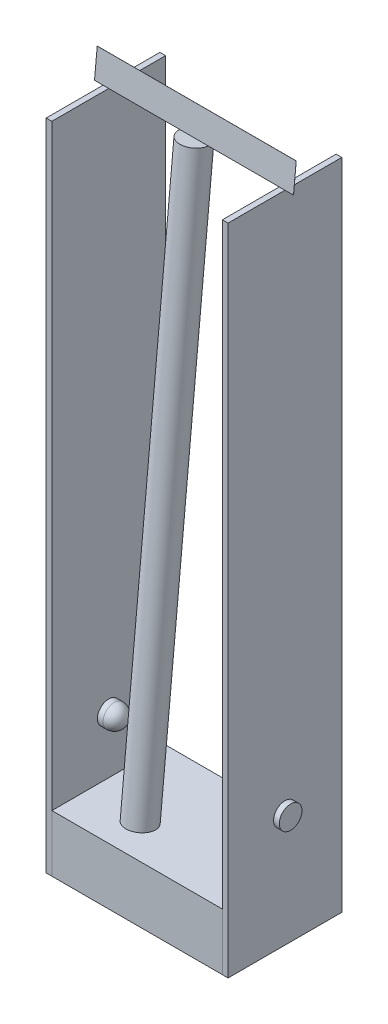
ISO-10303-21;
HEADER;
FILE_DESCRIPTION(('STEP AP214'),'2;1');
FILE_NAME('part.step','',(''),(''),'','','');
FILE_SCHEMA(('AUTOMOTIVE_DESIGN { 1 0 10303 214 1 1 1 1 }'));
ENDSEC;
DATA;
#1=APPLICATION_CONTEXT('core data for automotive mechanical design processes');
#2=APPLICATION_PROTOCOL_DEFINITION('international standard','automotive_design',2000,#1);
#3=PRODUCT_CONTEXT('',#1,'mechanical');
#4=PRODUCT('Part','Part','',(#3));
#5=PRODUCT_RELATED_PRODUCT_CATEGORY('part','',(#4));
#6=PRODUCT_DEFINITION_FORMATION('','',#4);
#7=PRODUCT_DEFINITION_CONTEXT('part definition',#1,'design');
#8=PRODUCT_DEFINITION('design','',#6,#7);
#9=PRODUCT_DEFINITION_SHAPE('','',#8);
#10=(LENGTH_UNIT() NAMED_UNIT(*) SI_UNIT(.MILLI.,.METRE.));
#11=(NAMED_UNIT(*) PLANE_ANGLE_UNIT() SI_UNIT($,.RADIAN.));
#12=(NAMED_UNIT(*) SI_UNIT($,.STERADIAN.) SOLID_ANGLE_UNIT());
#13=UNCERTAINTY_MEASURE_WITH_UNIT(LENGTH_MEASURE(1.E-05),#10,'distance_accuracy_value','');
#14=(GEOMETRIC_REPRESENTATION_CONTEXT(3) GLOBAL_UNCERTAINTY_ASSIGNED_CONTEXT((#13)) GLOBAL_UNIT_ASSIGNED_CONTEXT((#10,
#11,#12)) REPRESENTATION_CONTEXT('',''));
#15=CARTESIAN_POINT('',(0.,0.,0.));
#16=DIRECTION('',(0.,0.,1.));
#17=DIRECTION('',(1.,0.,0.));
#18=AXIS2_PLACEMENT_3D('',#15,#16,#17);
#19=CARTESIAN_POINT('',(17.5,114.999051909074,-0.00995495472593605));
#20=DIRECTION('',(0.,0.995495472593952,-0.0948090926279954));
#21=DIRECTION('',(0.,0.0948090926279955,0.995495472593952));
#22=AXIS2_PLACEMENT_3D('',#19,#20,#21);
#23=PLANE('',#22);
#24=CARTESIAN_POINT('',(0.,114.999051909074,-0.00995495472593845));
#25=DIRECTION('',(0.,-0.995495472593952,0.0948090926279955));
#26=DIRECTION('',(0.,-0.0948090926279955,-0.995495472593952));
#27=AXIS2_PLACEMENT_3D('',#24,#25,#26);
#28=CIRCLE('',#27,2.5);
#29=CARTESIAN_POINT('',(2.5,114.999051909074,-0.00995495472594131));
#30=VERTEX_POINT('',#29);
#31=CARTESIAN_POINT('',(2.49997999992,115.,0.));
#32=VERTEX_POINT('',#31);
#33=EDGE_CURVE('E58',#30,#32,#28,.T.);
#34=ORIENTED_EDGE('',*,*,#33,.F.);
#35=DIRECTION('',(-1.,0.,0.));
#36=VECTOR('',#35,1.);
#37=CARTESIAN_POINT('',(17.5,114.999051909074,-0.00995495472593605));
#38=LINE('',#37,#36);
#39=CARTESIAN_POINT('',(17.5,114.999051909074,-0.00995495472593605));
#40=VERTEX_POINT('',#39);
#41=EDGE_CURVE('E108',#40,#30,#38,.T.);
#42=ORIENTED_EDGE('',*,*,#41,.F.);
#43=DIRECTION('',(0.,0.0948090926279954,0.995495472593952));
#44=VECTOR('',#43,1.);
#45=CARTESIAN_POINT('',(17.5,114.999051909074,-0.00995495472593605));
#46=LINE('',#45,#44);
#47=CARTESIAN_POINT('',(17.5,115.,0.));
#48=VERTEX_POINT('',#47);
#49=EDGE_CURVE('E135',#40,#48,#46,.T.);
#50=ORIENTED_EDGE('',*,*,#49,.T.);
#51=DIRECTION('',(-1.,0.,0.));
#52=VECTOR('',#51,1.);
#53=CARTESIAN_POINT('',(17.5,115.,0.));
#54=LINE('',#53,#52);
#55=EDGE_CURVE('E136',#48,#32,#54,.T.);
#56=ORIENTED_EDGE('',*,*,#55,.T.);
#57=EDGE_LOOP('',(#34,#42,#50,#56));
#58=FACE_BOUND('',#57,.T.);
#59=ADVANCED_FACE('F48',(#58),#23,.F.);
#60=CARTESIAN_POINT('',(-2.49997999992,115.,0.));
#61=VERTEX_POINT('',#60);
#62=CARTESIAN_POINT('',(-2.5,114.999051909074,-0.00995495472594126));
#63=VERTEX_POINT('',#62);
#64=EDGE_CURVE('E12',#61,#63,#28,.T.);
#65=ORIENTED_EDGE('',*,*,#64,.F.);
#66=CARTESIAN_POINT('',(-17.5,115.,0.));
#67=VERTEX_POINT('',#66);
#68=EDGE_CURVE('E140',#61,#67,#54,.T.);
#69=ORIENTED_EDGE('',*,*,#68,.T.);
#70=DIRECTION('',(0.,0.0948090926279954,0.995495472593952));
#71=VECTOR('',#70,1.);
#72=CARTESIAN_POINT('',(-17.5,114.999051909074,-0.00995495472593605));
#73=LINE('',#72,#71);
#74=CARTESIAN_POINT('',(-17.5,114.999051909074,-0.00995495472593605));
#75=VERTEX_POINT('',#74);
#76=EDGE_CURVE('E52',#75,#67,#73,.T.);
#77=ORIENTED_EDGE('',*,*,#76,.F.);
#78=EDGE_CURVE('E105',#63,#75,#38,.T.);
#79=ORIENTED_EDGE('',*,*,#78,.F.);
#80=EDGE_LOOP('',(#65,#69,#77,#79));
#81=FACE_BOUND('',#80,.T.);
#82=ADVANCED_FACE('F50',(#81),#23,.F.);
#83=CARTESIAN_POINT('',(-17.5,114.999051909074,-0.00995495472593605));
#84=DIRECTION('',(1.,0.,0.));
#85=DIRECTION('',(0.,0.,-1.));
#86=AXIS2_PLACEMENT_3D('',#83,#84,#85);
#87=PLANE('',#86);
#88=DIRECTION('',(0.,0.995495472593952,-0.0948090926279954));
#89=VECTOR('',#88,1.);
#90=CARTESIAN_POINT('',(-17.5,115.,0.));
#91=LINE('',#90,#89);
#92=CARTESIAN_POINT('',(-17.5,119.97747736297,-0.474045463139974));
#93=VERTEX_POINT('',#92);
#94=EDGE_CURVE('E138',#67,#93,#91,.T.);
#95=ORIENTED_EDGE('',*,*,#94,.T.);
#96=DIRECTION('',(0.,0.0948090926279954,0.995495472593952));
#97=VECTOR('',#96,1.);
#98=CARTESIAN_POINT('',(-17.5,119.976529272043,-0.484000417865913));
#99=LINE('',#98,#97);
#100=CARTESIAN_POINT('',(-17.5,119.976529272043,-0.484000417865913));
#101=VERTEX_POINT('',#100);
#102=EDGE_CURVE('E150',#101,#93,#99,.T.);
#103=ORIENTED_EDGE('',*,*,#102,.F.);
#104=DIRECTION('',(0.,0.995495472593952,-0.0948090926279954));
#105=VECTOR('',#104,1.);
#106=CARTESIAN_POINT('',(-17.5,114.999051909074,-0.00995495472593605));
#107=LINE('',#106,#105);
#108=EDGE_CURVE('E127',#75,#101,#107,.T.);
#109=ORIENTED_EDGE('',*,*,#108,.F.);
#110=ORIENTED_EDGE('',*,*,#76,.T.);
#111=EDGE_LOOP('',(#95,#103,#109,#110));
#112=FACE_BOUND('',#111,.T.);
#113=ADVANCED_FACE('F155',(#112),#87,.F.);
#114=CARTESIAN_POINT('',(17.5,119.976529272043,-0.484000417865913));
#115=DIRECTION('',(0.,0.995495472593952,-0.0948090926279954));
#116=DIRECTION('',(0.,0.0948090926279955,0.995495472593952));
#117=AXIS2_PLACEMENT_3D('',#114,#115,#116);
#118=PLANE('',#117);
#119=DIRECTION('',(-1.,0.,0.));
#120=VECTOR('',#119,1.);
#121=CARTESIAN_POINT('',(17.5,119.97747736297,-0.474045463139974));
#122=LINE('',#121,#120);
#123=CARTESIAN_POINT('',(17.5,119.97747736297,-0.474045463139974));
#124=VERTEX_POINT('',#123);
#125=EDGE_CURVE('E143',#124,#93,#122,.T.);
#126=ORIENTED_EDGE('',*,*,#125,.F.);
#127=DIRECTION('',(0.,0.0948090926279954,0.995495472593952));
#128=VECTOR('',#127,1.);
#129=CARTESIAN_POINT('',(17.5,119.976529272043,-0.484000417865913));
#130=LINE('',#129,#128);
#131=CARTESIAN_POINT('',(17.5,119.976529272043,-0.484000417865913));
#132=VERTEX_POINT('',#131);
#133=EDGE_CURVE('E149',#132,#124,#130,.T.);
#134=ORIENTED_EDGE('',*,*,#133,.F.);
#135=DIRECTION('',(-1.,0.,0.));
#136=VECTOR('',#135,1.);
#137=CARTESIAN_POINT('',(17.5,119.976529272043,-0.484000417865913));
#138=LINE('',#137,#136);
#139=EDGE_CURVE('E129',#132,#101,#138,.T.);
#140=ORIENTED_EDGE('',*,*,#139,.T.);
#141=ORIENTED_EDGE('',*,*,#102,.T.);
#142=EDGE_LOOP('',(#126,#134,#140,#141));
#143=FACE_BOUND('',#142,.T.);
#144=ADVANCED_FACE('F169',(#143),#118,.T.);
#145=CARTESIAN_POINT('',(17.5,114.999051909074,-0.00995495472593605));
#146=DIRECTION('',(1.,0.,0.));
#147=DIRECTION('',(0.,1.,0.));
#148=AXIS2_PLACEMENT_3D('',#145,#146,#147);
#149=PLANE('',#148);
#150=DIRECTION('',(0.,0.995495472593952,-0.0948090926279954));
#151=VECTOR('',#150,1.);
#152=CARTESIAN_POINT('',(17.5,115.,0.));
#153=LINE('',#152,#151);
#154=EDGE_CURVE('E115',#48,#124,#153,.T.);
#155=ORIENTED_EDGE('',*,*,#154,.F.);
#156=ORIENTED_EDGE('',*,*,#49,.F.);
#157=DIRECTION('',(0.,0.995495472593952,-0.0948090926279954));
#158=VECTOR('',#157,1.);
#159=CARTESIAN_POINT('',(17.5,114.999051909074,-0.00995495472593605));
#160=LINE('',#159,#158);
#161=EDGE_CURVE('E132',#40,#132,#160,.T.);
#162=ORIENTED_EDGE('',*,*,#161,.T.);
#163=ORIENTED_EDGE('',*,*,#133,.T.);
#164=EDGE_LOOP('',(#155,#156,#162,#163));
#165=FACE_BOUND('',#164,.T.);
#166=ADVANCED_FACE('F160',(#165),#149,.T.);
#167=CARTESIAN_POINT('',(0.,1.03275977424226,10.8439776295437));
#168=DIRECTION('',(0.,-0.0948090926279954,-0.995495472593952));
#169=DIRECTION('',(0.,0.995495472593952,-0.0948090926279954));
#170=AXIS2_PLACEMENT_3D('',#167,#168,#169);
#171=PLANE('',#170);
#172=ORIENTED_EDGE('',*,*,#41,.T.);
#173=EDGE_CURVE('E103',#30,#63,#38,.T.);
#174=ORIENTED_EDGE('',*,*,#173,.T.);
#175=ORIENTED_EDGE('',*,*,#78,.T.);
#176=ORIENTED_EDGE('',*,*,#108,.T.);
#177=ORIENTED_EDGE('',*,*,#139,.F.);
#178=ORIENTED_EDGE('',*,*,#161,.F.);
#179=EDGE_LOOP('',(#172,#174,#175,#176,#177,#178));
#180=FACE_BOUND('',#179,.T.);
#181=ADVANCED_FACE('F104',(#180),#171,.T.);
#182=CARTESIAN_POINT('',(0.,1.03370786516854,10.8539325842697));
#183=DIRECTION('',(0.,-0.0948090926279954,-0.995495472593952));
#184=DIRECTION('',(0.,0.995495472593952,-0.0948090926279954));
#185=AXIS2_PLACEMENT_3D('',#182,#183,#184);
#186=PLANE('',#185);
#187=ORIENTED_EDGE('',*,*,#55,.F.);
#188=ORIENTED_EDGE('',*,*,#154,.T.);
#189=ORIENTED_EDGE('',*,*,#125,.T.);
#190=ORIENTED_EDGE('',*,*,#94,.F.);
#191=ORIENTED_EDGE('',*,*,#68,.F.);
#192=EDGE_CURVE('E139',#32,#61,#54,.T.);
#193=ORIENTED_EDGE('',*,*,#192,.F.);
#194=EDGE_LOOP('',(#187,#188,#189,#190,#191,#193));
#195=FACE_BOUND('',#194,.T.);
#196=ADVANCED_FACE('F177',(#195),#186,.F.);
#197=CARTESIAN_POINT('',(0.,114.999051909074,-0.00995495472593845));
#198=DIRECTION('',(0.,-0.995495472593952,0.0948090926279955));
#199=DIRECTION('',(0.,-0.0948090926279955,-0.995495472593952));
#200=AXIS2_PLACEMENT_3D('',#197,#198,#199);
#201=PLANE('',#200);
#202=EDGE_CURVE('E59',#32,#61,#28,.T.);
#203=ORIENTED_EDGE('',*,*,#202,.F.);
#204=ORIENTED_EDGE('',*,*,#192,.T.);
#205=EDGE_LOOP('',(#203,#204));
#206=FACE_BOUND('',#205,.T.);
#207=ADVANCED_FACE('F180',(#206),#201,.F.);
#208=CARTESIAN_POINT('',(0.,15.4495046496786,9.47095430807361));
#209=DIRECTION('',(0.,0.995495472593952,-0.0948090926279955));
#210=DIRECTION('',(0.,0.0948090926279955,0.995495472593952));
#211=AXIS2_PLACEMENT_3D('',#208,#209,#210);
#212=CYLINDRICAL_SURFACE('',#211,2.5);
#213=CARTESIAN_POINT('',(0.,15.4495046496786,9.47095430807361));
#214=DIRECTION('',(0.,-0.995495472593952,0.0948090926279955));
#215=DIRECTION('',(0.,-0.0948090926279955,-0.995495472593952));
#216=AXIS2_PLACEMENT_3D('',#213,#214,#215);
#217=CIRCLE('',#216,2.5);
#218=CARTESIAN_POINT('',(0.,15.2124819181086,6.98221562658873));
#219=VERTEX_POINT('',#218);
#220=EDGE_CURVE('E124',#219,#219,#217,.T.);
#221=ORIENTED_EDGE('',*,*,#220,.F.);
#222=EDGE_LOOP('',(#221));
#223=FACE_BOUND('',#222,.T.);
#224=ORIENTED_EDGE('',*,*,#33,.T.);
#225=ORIENTED_EDGE('',*,*,#202,.T.);
#226=ORIENTED_EDGE('',*,*,#64,.T.);
#227=EDGE_CURVE('E116',#63,#30,#28,.T.);
#228=ORIENTED_EDGE('',*,*,#227,.T.);
#229=EDGE_LOOP('',(#224,#225,#226,#228));
#230=FACE_BOUND('',#229,.T.);
#231=ADVANCED_FACE('F120',(#223,#230),#212,.T.);
#232=CARTESIAN_POINT('',(0.,15.4495046496786,9.47095430807361));
#233=DIRECTION('',(0.,-0.995495472593952,0.0948090926279955));
#234=DIRECTION('',(0.,-0.0948090926279955,-0.995495472593952));
#235=AXIS2_PLACEMENT_3D('',#232,#233,#234);
#236=PLANE('',#235);
#237=ORIENTED_EDGE('',*,*,#220,.T.);
#238=EDGE_LOOP('',(#237));
#239=FACE_BOUND('',#238,.T.);
#240=ADVANCED_FACE('F186',(#239),#236,.T.);
#241=ORIENTED_EDGE('',*,*,#173,.F.);
#242=ORIENTED_EDGE('',*,*,#227,.F.);
#243=EDGE_LOOP('',(#241,#242));
#244=FACE_BOUND('',#243,.T.);
#245=ADVANCED_FACE('F117',(#244),#201,.F.);
#246=CLOSED_SHELL('',(#59,#82,#113,#144,#166,#181,#196,#207,#231,#240,#245));
#247=MANIFOLD_SOLID_BREP('B2',#246);
#248=CARTESIAN_POINT('',(12.,20.,0.));
#249=DIRECTION('',(1.,0.,0.));
#250=DIRECTION('',(0.,0.,1.));
#251=AXIS2_PLACEMENT_3D('',#248,#249,#250);
#252=CYLINDRICAL_SURFACE('',#251,2.);
#253=CARTESIAN_POINT('',(14.,20.,0.));
#254=DIRECTION('',(-1.,0.,0.));
#255=DIRECTION('',(0.,0.,1.));
#256=AXIS2_PLACEMENT_3D('',#253,#254,#255);
#257=CIRCLE('',#256,2.);
#258=CARTESIAN_POINT('',(14.,20.,2.00000000000001));
#259=VERTEX_POINT('',#258);
#260=EDGE_CURVE('E47',#259,#259,#257,.T.);
#261=ORIENTED_EDGE('',*,*,#260,.F.);
#262=EDGE_LOOP('',(#261));
#263=FACE_BOUND('',#262,.T.);
#264=CARTESIAN_POINT('',(17.,20.,0.));
#265=DIRECTION('',(-1.,0.,0.));
#266=DIRECTION('',(0.,0.,1.));
#267=AXIS2_PLACEMENT_3D('',#264,#265,#266);
#268=CIRCLE('',#267,2.);
#269=CARTESIAN_POINT('',(17.,20.,2.00000000000001));
#270=VERTEX_POINT('',#269);
#271=EDGE_CURVE('E275',#270,#270,#268,.T.);
#272=ORIENTED_EDGE('',*,*,#271,.T.);
#273=EDGE_LOOP('',(#272));
#274=FACE_BOUND('',#273,.T.);
#275=ADVANCED_FACE('F268',(#263,#274),#252,.T.);
#276=CARTESIAN_POINT('',(17.,20.,0.));
#277=DIRECTION('',(1.,0.,0.));
#278=DIRECTION('',(0.,0.,1.));
#279=AXIS2_PLACEMENT_3D('',#276,#277,#278);
#280=PLANE('',#279);
#281=ORIENTED_EDGE('',*,*,#271,.F.);
#282=EDGE_LOOP('',(#281));
#283=FACE_BOUND('',#282,.T.);
#284=ADVANCED_FACE('F282',(#283),#280,.T.);
#285=CARTESIAN_POINT('',(14.,20.,0.));
#286=DIRECTION('',(1.,0.,0.));
#287=DIRECTION('',(0.,0.,1.));
#288=AXIS2_PLACEMENT_3D('',#285,#286,#287);
#289=SPHERICAL_SURFACE('',#288,2.);
#290=ORIENTED_EDGE('',*,*,#260,.T.);
#291=EDGE_LOOP('',(#290));
#292=FACE_BOUND('',#291,.T.);
#293=ADVANCED_FACE('F270',(#292),#289,.T.);
#294=CLOSED_SHELL('',(#275,#284,#293));
#295=MANIFOLD_SOLID_BREP('B6',#294);
#296=CARTESIAN_POINT('',(16.,0.,-10.));
#297=DIRECTION('',(0.,0.,1.));
#298=DIRECTION('',(-1.,0.,0.));
#299=AXIS2_PLACEMENT_3D('',#296,#297,#298);
#300=PLANE('',#299);
#301=DIRECTION('',(0.,-1.,0.));
#302=VECTOR('',#301,1.);
#303=CARTESIAN_POINT('',(15.,0.,-10.));
#304=LINE('',#303,#302);
#305=CARTESIAN_POINT('',(15.,115.,-10.));
#306=VERTEX_POINT('',#305);
#307=CARTESIAN_POINT('',(15.,0.,-10.));
#308=VERTEX_POINT('',#307);
#309=EDGE_CURVE('E389',#306,#308,#304,.T.);
#310=ORIENTED_EDGE('',*,*,#309,.F.);
#311=DIRECTION('',(-1.,0.,0.));
#312=VECTOR('',#311,1.);
#313=CARTESIAN_POINT('',(16.,115.,-10.));
#314=LINE('',#313,#312);
#315=CARTESIAN_POINT('',(16.,115.,-10.));
#316=VERTEX_POINT('',#315);
#317=EDGE_CURVE('E388',#316,#306,#314,.T.);
#318=ORIENTED_EDGE('',*,*,#317,.F.);
#319=DIRECTION('',(0.,-1.,0.));
#320=VECTOR('',#319,1.);
#321=CARTESIAN_POINT('',(16.,0.,-10.));
#322=LINE('',#321,#320);
#323=CARTESIAN_POINT('',(16.,0.,-10.));
#324=VERTEX_POINT('',#323);
#325=EDGE_CURVE('E382',#316,#324,#322,.T.);
#326=ORIENTED_EDGE('',*,*,#325,.T.);
#327=DIRECTION('',(-1.,0.,0.));
#328=VECTOR('',#327,1.);
#329=CARTESIAN_POINT('',(16.,0.,-10.));
#330=LINE('',#329,#328);
#331=EDGE_CURVE('E266',#324,#308,#330,.T.);
#332=ORIENTED_EDGE('',*,*,#331,.T.);
#333=EDGE_LOOP('',(#310,#318,#326,#332));
#334=FACE_BOUND('',#333,.T.);
#335=ADVANCED_FACE('F323',(#334),#300,.F.);
#336=CARTESIAN_POINT('',(16.,0.,-10.));
#337=DIRECTION('',(0.,1.,0.));
#338=DIRECTION('',(0.,0.,1.));
#339=AXIS2_PLACEMENT_3D('',#336,#337,#338);
#340=PLANE('',#339);
#341=DIRECTION('',(0.,0.,1.));
#342=VECTOR('',#341,1.);
#343=CARTESIAN_POINT('',(15.,0.,-10.));
#344=LINE('',#343,#342);
#345=CARTESIAN_POINT('',(15.,0.,10.));
#346=VERTEX_POINT('',#345);
#347=EDGE_CURVE('E391',#308,#346,#344,.T.);
#348=ORIENTED_EDGE('',*,*,#347,.F.);
#349=ORIENTED_EDGE('',*,*,#331,.F.);
#350=DIRECTION('',(0.,0.,1.));
#351=VECTOR('',#350,1.);
#352=CARTESIAN_POINT('',(16.,0.,-10.));
#353=LINE('',#352,#351);
#354=CARTESIAN_POINT('',(16.,0.,10.));
#355=VERTEX_POINT('',#354);
#356=EDGE_CURVE('E365',#324,#355,#353,.T.);
#357=ORIENTED_EDGE('',*,*,#356,.T.);
#358=DIRECTION('',(-1.,0.,0.));
#359=VECTOR('',#358,1.);
#360=CARTESIAN_POINT('',(16.,0.,10.));
#361=LINE('',#360,#359);
#362=EDGE_CURVE('E332',#355,#346,#361,.T.);
#363=ORIENTED_EDGE('',*,*,#362,.T.);
#364=EDGE_LOOP('',(#348,#349,#357,#363));
#365=FACE_BOUND('',#364,.T.);
#366=ADVANCED_FACE('F380',(#365),#340,.F.);
#367=CARTESIAN_POINT('',(16.,0.,10.));
#368=DIRECTION('',(0.,0.,-1.));
#369=DIRECTION('',(1.,0.,0.));
#370=AXIS2_PLACEMENT_3D('',#367,#368,#369);
#371=PLANE('',#370);
#372=DIRECTION('',(0.,1.,0.));
#373=VECTOR('',#372,1.);
#374=CARTESIAN_POINT('',(15.,0.,10.));
#375=LINE('',#374,#373);
#376=CARTESIAN_POINT('',(15.,115.,9.99999999999998));
#377=VERTEX_POINT('',#376);
#378=EDGE_CURVE('E375',#346,#377,#375,.T.);
#379=ORIENTED_EDGE('',*,*,#378,.F.);
#380=ORIENTED_EDGE('',*,*,#362,.F.);
#381=DIRECTION('',(0.,1.,0.));
#382=VECTOR('',#381,1.);
#383=CARTESIAN_POINT('',(16.,0.,10.));
#384=LINE('',#383,#382);
#385=CARTESIAN_POINT('',(16.,115.,9.99999999999998));
#386=VERTEX_POINT('',#385);
#387=EDGE_CURVE('E368',#355,#386,#384,.T.);
#388=ORIENTED_EDGE('',*,*,#387,.T.);
#389=DIRECTION('',(-1.,0.,0.));
#390=VECTOR('',#389,1.);
#391=CARTESIAN_POINT('',(16.,115.,9.99999999999998));
#392=LINE('',#391,#390);
#393=EDGE_CURVE('E378',#386,#377,#392,.T.);
#394=ORIENTED_EDGE('',*,*,#393,.T.);
#395=EDGE_LOOP('',(#379,#380,#388,#394));
#396=FACE_BOUND('',#395,.T.);
#397=ADVANCED_FACE('F374',(#396),#371,.F.);
#398=CARTESIAN_POINT('',(16.,115.,-10.));
#399=DIRECTION('',(0.,-1.,0.));
#400=DIRECTION('',(0.,0.,-1.));
#401=AXIS2_PLACEMENT_3D('',#398,#399,#400);
#402=PLANE('',#401);
#403=DIRECTION('',(0.,0.,-1.));
#404=VECTOR('',#403,1.);
#405=CARTESIAN_POINT('',(15.,115.,-10.));
#406=LINE('',#405,#404);
#407=EDGE_CURVE('E354',#377,#306,#406,.T.);
#408=ORIENTED_EDGE('',*,*,#407,.F.);
#409=ORIENTED_EDGE('',*,*,#393,.F.);
#410=DIRECTION('',(0.,0.,-1.));
#411=VECTOR('',#410,1.);
#412=CARTESIAN_POINT('',(16.,115.,-10.));
#413=LINE('',#412,#411);
#414=EDGE_CURVE('E340',#386,#316,#413,.T.);
#415=ORIENTED_EDGE('',*,*,#414,.T.);
#416=ORIENTED_EDGE('',*,*,#317,.T.);
#417=EDGE_LOOP('',(#408,#409,#415,#416));
#418=FACE_BOUND('',#417,.T.);
#419=ADVANCED_FACE('F401',(#418),#402,.F.);
#420=CARTESIAN_POINT('',(16.,0.,0.));
#421=DIRECTION('',(-1.,0.,0.));
#422=DIRECTION('',(0.,0.,-1.));
#423=AXIS2_PLACEMENT_3D('',#420,#421,#422);
#424=PLANE('',#423);
#425=CARTESIAN_POINT('',(16.,20.,0.));
#426=DIRECTION('',(-1.,0.,0.));
#427=DIRECTION('',(0.,0.,1.));
#428=AXIS2_PLACEMENT_3D('',#425,#426,#427);
#429=CIRCLE('',#428,2.);
#430=CARTESIAN_POINT('',(16.,20.,1.99999999999999));
#431=VERTEX_POINT('',#430);
#432=EDGE_CURVE('E392',#431,#431,#429,.T.);
#433=ORIENTED_EDGE('',*,*,#432,.T.);
#434=EDGE_LOOP('',(#433));
#435=FACE_BOUND('',#434,.T.);
#436=ORIENTED_EDGE('',*,*,#325,.F.);
#437=ORIENTED_EDGE('',*,*,#414,.F.);
#438=ORIENTED_EDGE('',*,*,#387,.F.);
#439=ORIENTED_EDGE('',*,*,#356,.F.);
#440=EDGE_LOOP('',(#436,#437,#438,#439));
#441=FACE_BOUND('',#440,.T.);
#442=ADVANCED_FACE('F370',(#435,#441),#424,.F.);
#443=CARTESIAN_POINT('',(15.,0.,0.));
#444=DIRECTION('',(-1.,0.,0.));
#445=DIRECTION('',(0.,0.,-1.));
#446=AXIS2_PLACEMENT_3D('',#443,#444,#445);
#447=PLANE('',#446);
#448=CARTESIAN_POINT('',(15.,20.,0.));
#449=DIRECTION('',(-1.,0.,0.));
#450=DIRECTION('',(0.,0.,1.));
#451=AXIS2_PLACEMENT_3D('',#448,#449,#450);
#452=CIRCLE('',#451,2.);
#453=CARTESIAN_POINT('',(15.,20.,2.));
#454=VERTEX_POINT('',#453);
#455=EDGE_CURVE('E326',#454,#454,#452,.T.);
#456=ORIENTED_EDGE('',*,*,#455,.F.);
#457=EDGE_LOOP('',(#456));
#458=FACE_BOUND('',#457,.T.);
#459=ORIENTED_EDGE('',*,*,#309,.T.);
#460=ORIENTED_EDGE('',*,*,#347,.T.);
#461=ORIENTED_EDGE('',*,*,#378,.T.);
#462=ORIENTED_EDGE('',*,*,#407,.T.);
#463=EDGE_LOOP('',(#459,#460,#461,#462));
#464=FACE_BOUND('',#463,.T.);
#465=ADVANCED_FACE('F397',(#458,#464),#447,.T.);
#466=CARTESIAN_POINT('',(17.5,20.,0.));
#467=DIRECTION('',(-1.,0.,0.));
#468=DIRECTION('',(0.,0.,1.));
#469=AXIS2_PLACEMENT_3D('',#466,#467,#468);
#470=CYLINDRICAL_SURFACE('',#469,2.);
#471=ORIENTED_EDGE('',*,*,#455,.T.);
#472=EDGE_LOOP('',(#471));
#473=FACE_BOUND('',#472,.T.);
#474=ORIENTED_EDGE('',*,*,#432,.F.);
#475=EDGE_LOOP('',(#474));
#476=FACE_BOUND('',#475,.T.);
#477=ADVANCED_FACE('F458',(#473,#476),#470,.F.);
#478=CLOSED_SHELL('',(#335,#366,#397,#419,#442,#465,#477));
#479=MANIFOLD_SOLID_BREP('B42',#478);
#480=CARTESIAN_POINT('',(-12.,20.,0.));
#481=DIRECTION('',(-1.,0.,0.));
#482=DIRECTION('',(0.,0.,1.));
#483=AXIS2_PLACEMENT_3D('',#480,#481,#482);
#484=CYLINDRICAL_SURFACE('',#483,2.);
#485=CARTESIAN_POINT('',(-14.,20.,0.));
#486=DIRECTION('',(-1.,0.,0.));
#487=DIRECTION('',(0.,0.,1.));
#488=AXIS2_PLACEMENT_3D('',#485,#486,#487);
#489=CIRCLE('',#488,2.);
#490=CARTESIAN_POINT('',(-14.,20.,2.00000000000001));
#491=VERTEX_POINT('',#490);
#492=EDGE_CURVE('E322',#491,#491,#489,.T.);
#493=ORIENTED_EDGE('',*,*,#492,.T.);
#494=EDGE_LOOP('',(#493));
#495=FACE_BOUND('',#494,.T.);
#496=CARTESIAN_POINT('',(-17.,20.,0.));
#497=DIRECTION('',(-1.,0.,0.));
#498=DIRECTION('',(0.,0.,1.));
#499=AXIS2_PLACEMENT_3D('',#496,#497,#498);
#500=CIRCLE('',#499,2.);
#501=CARTESIAN_POINT('',(-17.,20.,2.00000000000001));
#502=VERTEX_POINT('',#501);
#503=EDGE_CURVE('E510',#502,#502,#500,.T.);
#504=ORIENTED_EDGE('',*,*,#503,.F.);
#505=EDGE_LOOP('',(#504));
#506=FACE_BOUND('',#505,.T.);
#507=ADVANCED_FACE('F503',(#495,#506),#484,.T.);
#508=CARTESIAN_POINT('',(-17.,20.,0.));
#509=DIRECTION('',(-1.,0.,0.));
#510=DIRECTION('',(0.,0.,1.));
#511=AXIS2_PLACEMENT_3D('',#508,#509,#510);
#512=PLANE('',#511);
#513=ORIENTED_EDGE('',*,*,#503,.T.);
#514=EDGE_LOOP('',(#513));
#515=FACE_BOUND('',#514,.T.);
#516=ADVANCED_FACE('F516',(#515),#512,.T.);
#517=CARTESIAN_POINT('',(-14.,20.,0.));
#518=DIRECTION('',(-1.,0.,0.));
#519=DIRECTION('',(0.,0.,1.));
#520=AXIS2_PLACEMENT_3D('',#517,#518,#519);
#521=SPHERICAL_SURFACE('',#520,2.);
#522=ORIENTED_EDGE('',*,*,#492,.F.);
#523=EDGE_LOOP('',(#522));
#524=FACE_BOUND('',#523,.T.);
#525=ADVANCED_FACE('F505',(#524),#521,.T.);
#526=CLOSED_SHELL('',(#507,#516,#525));
#527=MANIFOLD_SOLID_BREP('B260',#526);
#528=CARTESIAN_POINT('',(-16.,0.,-10.));
#529=DIRECTION('',(0.,0.,1.));
#530=DIRECTION('',(1.,0.,0.));
#531=AXIS2_PLACEMENT_3D('',#528,#529,#530);
#532=PLANE('',#531);
#533=DIRECTION('',(0.,-1.,0.));
#534=VECTOR('',#533,1.);
#535=CARTESIAN_POINT('',(-15.,0.,-10.));
#536=LINE('',#535,#534);
#537=CARTESIAN_POINT('',(-15.,115.,-10.));
#538=VERTEX_POINT('',#537);
#539=CARTESIAN_POINT('',(-15.,0.,-10.));
#540=VERTEX_POINT('',#539);
#541=EDGE_CURVE('E618',#538,#540,#536,.T.);
#542=ORIENTED_EDGE('',*,*,#541,.T.);
#543=DIRECTION('',(1.,0.,0.));
#544=VECTOR('',#543,1.);
#545=CARTESIAN_POINT('',(-16.,0.,-10.));
#546=LINE('',#545,#544);
#547=CARTESIAN_POINT('',(-16.,0.,-10.));
#548=VERTEX_POINT('',#547);
#549=EDGE_CURVE('E501',#548,#540,#546,.T.);
#550=ORIENTED_EDGE('',*,*,#549,.F.);
#551=DIRECTION('',(0.,-1.,0.));
#552=VECTOR('',#551,1.);
#553=CARTESIAN_POINT('',(-16.,0.,-10.));
#554=LINE('',#553,#552);
#555=CARTESIAN_POINT('',(-16.,115.,-10.));
#556=VERTEX_POINT('',#555);
#557=EDGE_CURVE('E605',#556,#548,#554,.T.);
#558=ORIENTED_EDGE('',*,*,#557,.F.);
#559=DIRECTION('',(1.,0.,0.));
#560=VECTOR('',#559,1.);
#561=CARTESIAN_POINT('',(-16.,115.,-10.));
#562=LINE('',#561,#560);
#563=EDGE_CURVE('E614',#556,#538,#562,.T.);
#564=ORIENTED_EDGE('',*,*,#563,.T.);
#565=EDGE_LOOP('',(#542,#550,#558,#564));
#566=FACE_BOUND('',#565,.T.);
#567=ADVANCED_FACE('F553',(#566),#532,.F.);
#568=CARTESIAN_POINT('',(-16.,0.,-10.));
#569=DIRECTION('',(0.,1.,0.));
#570=DIRECTION('',(0.,0.,1.));
#571=AXIS2_PLACEMENT_3D('',#568,#569,#570);
#572=PLANE('',#571);
#573=DIRECTION('',(0.,0.,1.));
#574=VECTOR('',#573,1.);
#575=CARTESIAN_POINT('',(-15.,0.,-10.));
#576=LINE('',#575,#574);
#577=CARTESIAN_POINT('',(-15.,0.,10.));
#578=VERTEX_POINT('',#577);
#579=EDGE_CURVE('E609',#540,#578,#576,.T.);
#580=ORIENTED_EDGE('',*,*,#579,.T.);
#581=DIRECTION('',(1.,0.,0.));
#582=VECTOR('',#581,1.);
#583=CARTESIAN_POINT('',(-16.,0.,10.));
#584=LINE('',#583,#582);
#585=CARTESIAN_POINT('',(-16.,0.,10.));
#586=VERTEX_POINT('',#585);
#587=EDGE_CURVE('E562',#586,#578,#584,.T.);
#588=ORIENTED_EDGE('',*,*,#587,.F.);
#589=DIRECTION('',(0.,0.,1.));
#590=VECTOR('',#589,1.);
#591=CARTESIAN_POINT('',(-16.,0.,-10.));
#592=LINE('',#591,#590);
#593=EDGE_CURVE('E600',#548,#586,#592,.T.);
#594=ORIENTED_EDGE('',*,*,#593,.F.);
#595=ORIENTED_EDGE('',*,*,#549,.T.);
#596=EDGE_LOOP('',(#580,#588,#594,#595));
#597=FACE_BOUND('',#596,.T.);
#598=ADVANCED_FACE('F608',(#597),#572,.F.);
#599=CARTESIAN_POINT('',(-16.,0.,10.));
#600=DIRECTION('',(0.,0.,-1.));
#601=DIRECTION('',(-1.,0.,0.));
#602=AXIS2_PLACEMENT_3D('',#599,#600,#601);
#603=PLANE('',#602);
#604=DIRECTION('',(0.,1.,0.));
#605=VECTOR('',#604,1.);
#606=CARTESIAN_POINT('',(-15.,0.,10.));
#607=LINE('',#606,#605);
#608=CARTESIAN_POINT('',(-15.,115.,9.99999999999998));
#609=VERTEX_POINT('',#608);
#610=EDGE_CURVE('E587',#578,#609,#607,.T.);
#611=ORIENTED_EDGE('',*,*,#610,.T.);
#612=DIRECTION('',(1.,0.,0.));
#613=VECTOR('',#612,1.);
#614=CARTESIAN_POINT('',(-16.,115.,9.99999999999998));
#615=LINE('',#614,#613);
#616=CARTESIAN_POINT('',(-16.,115.,9.99999999999998));
#617=VERTEX_POINT('',#616);
#618=EDGE_CURVE('E610',#617,#609,#615,.T.);
#619=ORIENTED_EDGE('',*,*,#618,.F.);
#620=DIRECTION('',(0.,1.,0.));
#621=VECTOR('',#620,1.);
#622=CARTESIAN_POINT('',(-16.,0.,10.));
#623=LINE('',#622,#621);
#624=EDGE_CURVE('E603',#586,#617,#623,.T.);
#625=ORIENTED_EDGE('',*,*,#624,.F.);
#626=ORIENTED_EDGE('',*,*,#587,.T.);
#627=EDGE_LOOP('',(#611,#619,#625,#626));
#628=FACE_BOUND('',#627,.T.);
#629=ADVANCED_FACE('F612',(#628),#603,.F.);
#630=CARTESIAN_POINT('',(-16.,115.,-10.));
#631=DIRECTION('',(0.,-1.,0.));
#632=DIRECTION('',(0.,0.,-1.));
#633=AXIS2_PLACEMENT_3D('',#630,#631,#632);
#634=PLANE('',#633);
#635=DIRECTION('',(0.,0.,-1.));
#636=VECTOR('',#635,1.);
#637=CARTESIAN_POINT('',(-15.,115.,-10.));
#638=LINE('',#637,#636);
#639=EDGE_CURVE('E593',#609,#538,#638,.T.);
#640=ORIENTED_EDGE('',*,*,#639,.T.);
#641=ORIENTED_EDGE('',*,*,#563,.F.);
#642=DIRECTION('',(0.,0.,-1.));
#643=VECTOR('',#642,1.);
#644=CARTESIAN_POINT('',(-16.,115.,-10.));
#645=LINE('',#644,#643);
#646=EDGE_CURVE('E570',#617,#556,#645,.T.);
#647=ORIENTED_EDGE('',*,*,#646,.F.);
#648=ORIENTED_EDGE('',*,*,#618,.T.);
#649=EDGE_LOOP('',(#640,#641,#647,#648));
#650=FACE_BOUND('',#649,.T.);
#651=ADVANCED_FACE('F626',(#650),#634,.F.);
#652=CARTESIAN_POINT('',(-16.,0.,0.));
#653=DIRECTION('',(1.,0.,0.));
#654=DIRECTION('',(0.,0.,-1.));
#655=AXIS2_PLACEMENT_3D('',#652,#653,#654);
#656=PLANE('',#655);
#657=CARTESIAN_POINT('',(-16.,20.,0.));
#658=DIRECTION('',(1.,0.,0.));
#659=DIRECTION('',(0.,0.,-1.));
#660=AXIS2_PLACEMENT_3D('',#657,#658,#659);
#661=CIRCLE('',#660,2.);
#662=CARTESIAN_POINT('',(-16.,20.,-1.99999999999999));
#663=VERTEX_POINT('',#662);
#664=EDGE_CURVE('E621',#663,#663,#661,.T.);
#665=ORIENTED_EDGE('',*,*,#664,.T.);
#666=EDGE_LOOP('',(#665));
#667=FACE_BOUND('',#666,.T.);
#668=ORIENTED_EDGE('',*,*,#557,.T.);
#669=ORIENTED_EDGE('',*,*,#593,.T.);
#670=ORIENTED_EDGE('',*,*,#624,.T.);
#671=ORIENTED_EDGE('',*,*,#646,.T.);
#672=EDGE_LOOP('',(#668,#669,#670,#671));
#673=FACE_BOUND('',#672,.T.);
#674=ADVANCED_FACE('F601',(#667,#673),#656,.F.);
#675=CARTESIAN_POINT('',(-15.,0.,0.));
#676=DIRECTION('',(1.,0.,0.));
#677=DIRECTION('',(0.,0.,-1.));
#678=AXIS2_PLACEMENT_3D('',#675,#676,#677);
#679=PLANE('',#678);
#680=CARTESIAN_POINT('',(-15.,20.,0.));
#681=DIRECTION('',(1.,0.,0.));
#682=DIRECTION('',(0.,0.,-1.));
#683=AXIS2_PLACEMENT_3D('',#680,#681,#682);
#684=CIRCLE('',#683,2.);
#685=CARTESIAN_POINT('',(-15.,20.,-2.));
#686=VERTEX_POINT('',#685);
#687=EDGE_CURVE('E556',#686,#686,#684,.T.);
#688=ORIENTED_EDGE('',*,*,#687,.F.);
#689=EDGE_LOOP('',(#688));
#690=FACE_BOUND('',#689,.T.);
#691=ORIENTED_EDGE('',*,*,#541,.F.);
#692=ORIENTED_EDGE('',*,*,#639,.F.);
#693=ORIENTED_EDGE('',*,*,#610,.F.);
#694=ORIENTED_EDGE('',*,*,#579,.F.);
#695=EDGE_LOOP('',(#691,#692,#693,#694));
#696=FACE_BOUND('',#695,.T.);
#697=ADVANCED_FACE('F629',(#690,#696),#679,.T.);
#698=CARTESIAN_POINT('',(17.5,20.,0.));
#699=DIRECTION('',(-1.,0.,0.));
#700=DIRECTION('',(0.,0.,1.));
#701=AXIS2_PLACEMENT_3D('',#698,#699,#700);
#702=CYLINDRICAL_SURFACE('',#701,2.);
#703=ORIENTED_EDGE('',*,*,#687,.T.);
#704=EDGE_LOOP('',(#703));
#705=FACE_BOUND('',#704,.T.);
#706=ORIENTED_EDGE('',*,*,#664,.F.);
#707=EDGE_LOOP('',(#706));
#708=FACE_BOUND('',#707,.T.);
#709=ADVANCED_FACE('F638',(#705,#708),#702,.F.);
#710=CLOSED_SHELL('',(#567,#598,#629,#651,#674,#697,#709));
#711=MANIFOLD_SOLID_BREP('B317',#710);
#712=CARTESIAN_POINT('',(15.,10.,-10.));
#713=DIRECTION('',(-1.,0.,0.));
#714=DIRECTION('',(0.,0.,1.));
#715=AXIS2_PLACEMENT_3D('',#712,#713,#714);
#716=PLANE('',#715);
#717=DIRECTION('',(0.,0.,-1.));
#718=VECTOR('',#717,1.);
#719=CARTESIAN_POINT('',(15.,0.,-10.));
#720=LINE('',#719,#718);
#721=CARTESIAN_POINT('',(15.,0.,10.));
#722=VERTEX_POINT('',#721);
#723=CARTESIAN_POINT('',(15.,0.,-10.));
#724=VERTEX_POINT('',#723);
#725=EDGE_CURVE('E761',#722,#724,#720,.T.);
#726=ORIENTED_EDGE('',*,*,#725,.T.);
#727=DIRECTION('',(0.,-1.,0.));
#728=VECTOR('',#727,1.);
#729=CARTESIAN_POINT('',(15.,10.,-10.));
#730=LINE('',#729,#728);
#731=CARTESIAN_POINT('',(15.,10.,-10.));
#732=VERTEX_POINT('',#731);
#733=EDGE_CURVE('E551',#732,#724,#730,.T.);
#734=ORIENTED_EDGE('',*,*,#733,.F.);
#735=DIRECTION('',(0.,0.,-1.));
#736=VECTOR('',#735,1.);
#737=CARTESIAN_POINT('',(15.,10.,-10.));
#738=LINE('',#737,#736);
#739=CARTESIAN_POINT('',(15.,10.,10.));
#740=VERTEX_POINT('',#739);
#741=EDGE_CURVE('E749',#740,#732,#738,.T.);
#742=ORIENTED_EDGE('',*,*,#741,.F.);
#743=DIRECTION('',(0.,-1.,0.));
#744=VECTOR('',#743,1.);
#745=CARTESIAN_POINT('',(15.,10.,10.));
#746=LINE('',#745,#744);
#747=EDGE_CURVE('E757',#740,#722,#746,.T.);
#748=ORIENTED_EDGE('',*,*,#747,.T.);
#749=EDGE_LOOP('',(#726,#734,#742,#748));
#750=FACE_BOUND('',#749,.T.);
#751=ADVANCED_FACE('F698',(#750),#716,.F.);
#752=CARTESIAN_POINT('',(-15.,10.,-10.));
#753=DIRECTION('',(0.,0.,1.));
#754=DIRECTION('',(1.,0.,0.));
#755=AXIS2_PLACEMENT_3D('',#752,#753,#754);
#756=PLANE('',#755);
#757=DIRECTION('',(-1.,0.,0.));
#758=VECTOR('',#757,1.);
#759=CARTESIAN_POINT('',(-15.,0.,-10.));
#760=LINE('',#759,#758);
#761=CARTESIAN_POINT('',(-15.,0.,-10.));
#762=VERTEX_POINT('',#761);
#763=EDGE_CURVE('E753',#724,#762,#760,.T.);
#764=ORIENTED_EDGE('',*,*,#763,.T.);
#765=DIRECTION('',(0.,-1.,0.));
#766=VECTOR('',#765,1.);
#767=CARTESIAN_POINT('',(-15.,10.,-10.));
#768=LINE('',#767,#766);
#769=CARTESIAN_POINT('',(-15.,10.,-10.));
#770=VERTEX_POINT('',#769);
#771=EDGE_CURVE('E706',#770,#762,#768,.T.);
#772=ORIENTED_EDGE('',*,*,#771,.F.);
#773=DIRECTION('',(-1.,0.,0.));
#774=VECTOR('',#773,1.);
#775=CARTESIAN_POINT('',(-15.,10.,-10.));
#776=LINE('',#775,#774);
#777=EDGE_CURVE('E744',#732,#770,#776,.T.);
#778=ORIENTED_EDGE('',*,*,#777,.F.);
#779=ORIENTED_EDGE('',*,*,#733,.T.);
#780=EDGE_LOOP('',(#764,#772,#778,#779));
#781=FACE_BOUND('',#780,.T.);
#782=ADVANCED_FACE('F752',(#781),#756,.F.);
#783=CARTESIAN_POINT('',(-15.,10.,-10.));
#784=DIRECTION('',(1.,0.,0.));
#785=DIRECTION('',(0.,0.,-1.));
#786=AXIS2_PLACEMENT_3D('',#783,#784,#785);
#787=PLANE('',#786);
#788=DIRECTION('',(0.,0.,1.));
#789=VECTOR('',#788,1.);
#790=CARTESIAN_POINT('',(-15.,0.,-10.));
#791=LINE('',#790,#789);
#792=CARTESIAN_POINT('',(-15.,0.,10.));
#793=VERTEX_POINT('',#792);
#794=EDGE_CURVE('E731',#762,#793,#791,.T.);
#795=ORIENTED_EDGE('',*,*,#794,.T.);
#796=DIRECTION('',(0.,-1.,0.));
#797=VECTOR('',#796,1.);
#798=CARTESIAN_POINT('',(-15.,10.,10.));
#799=LINE('',#798,#797);
#800=CARTESIAN_POINT('',(-15.,10.,10.));
#801=VERTEX_POINT('',#800);
#802=EDGE_CURVE('E754',#801,#793,#799,.T.);
#803=ORIENTED_EDGE('',*,*,#802,.F.);
#804=DIRECTION('',(0.,0.,1.));
#805=VECTOR('',#804,1.);
#806=CARTESIAN_POINT('',(-15.,10.,-10.));
#807=LINE('',#806,#805);
#808=EDGE_CURVE('E747',#770,#801,#807,.T.);
#809=ORIENTED_EDGE('',*,*,#808,.F.);
#810=ORIENTED_EDGE('',*,*,#771,.T.);
#811=EDGE_LOOP('',(#795,#803,#809,#810));
#812=FACE_BOUND('',#811,.T.);
#813=ADVANCED_FACE('F755',(#812),#787,.F.);
#814=CARTESIAN_POINT('',(-15.,10.,10.));
#815=DIRECTION('',(0.,0.,-1.));
#816=DIRECTION('',(-1.,0.,0.));
#817=AXIS2_PLACEMENT_3D('',#814,#815,#816);
#818=PLANE('',#817);
#819=DIRECTION('',(1.,0.,0.));
#820=VECTOR('',#819,1.);
#821=CARTESIAN_POINT('',(-15.,0.,10.));
#822=LINE('',#821,#820);
#823=EDGE_CURVE('E737',#793,#722,#822,.T.);
#824=ORIENTED_EDGE('',*,*,#823,.T.);
#825=ORIENTED_EDGE('',*,*,#747,.F.);
#826=DIRECTION('',(1.,0.,0.));
#827=VECTOR('',#826,1.);
#828=CARTESIAN_POINT('',(-15.,10.,10.));
#829=LINE('',#828,#827);
#830=EDGE_CURVE('E714',#801,#740,#829,.T.);
#831=ORIENTED_EDGE('',*,*,#830,.F.);
#832=ORIENTED_EDGE('',*,*,#802,.T.);
#833=EDGE_LOOP('',(#824,#825,#831,#832));
#834=FACE_BOUND('',#833,.T.);
#835=ADVANCED_FACE('F768',(#834),#818,.F.);
#836=CARTESIAN_POINT('',(0.,10.,0.));
#837=DIRECTION('',(0.,1.,0.));
#838=DIRECTION('',(0.,0.,1.));
#839=AXIS2_PLACEMENT_3D('',#836,#837,#838);
#840=PLANE('',#839);
#841=ORIENTED_EDGE('',*,*,#741,.T.);
#842=ORIENTED_EDGE('',*,*,#777,.T.);
#843=ORIENTED_EDGE('',*,*,#808,.T.);
#844=ORIENTED_EDGE('',*,*,#830,.T.);
#845=EDGE_LOOP('',(#841,#842,#843,#844));
#846=FACE_BOUND('',#845,.T.);
#847=ADVANCED_FACE('F745',(#846),#840,.T.);
#848=CARTESIAN_POINT('',(0.,0.,0.));
#849=DIRECTION('',(0.,1.,0.));
#850=DIRECTION('',(0.,0.,1.));
#851=AXIS2_PLACEMENT_3D('',#848,#849,#850);
#852=PLANE('',#851);
#853=ORIENTED_EDGE('',*,*,#725,.F.);
#854=ORIENTED_EDGE('',*,*,#823,.F.);
#855=ORIENTED_EDGE('',*,*,#794,.F.);
#856=ORIENTED_EDGE('',*,*,#763,.F.);
#857=EDGE_LOOP('',(#853,#854,#855,#856));
#858=FACE_BOUND('',#857,.T.);
#859=ADVANCED_FACE('F771',(#858),#852,.F.);
#860=CLOSED_SHELL('',(#751,#782,#813,#835,#847,#859));
#861=MANIFOLD_SOLID_BREP('B495',#860);
#862=ADVANCED_BREP_SHAPE_REPRESENTATION('',(#18,#247,#295,#479,#527,#711,#861),#14);
#863=SHAPE_DEFINITION_REPRESENTATION(#9,#862);
ENDSEC;
END-ISO-10303-21;
